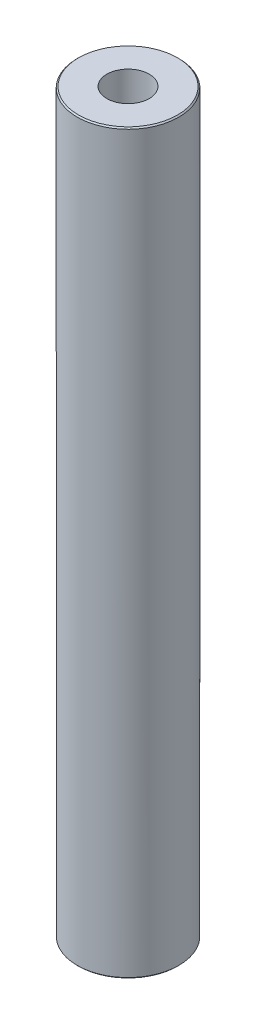
ISO-10303-21;
HEADER;
FILE_DESCRIPTION(('STEP AP214'),'2;1');
FILE_NAME('part.step','',(''),(''),'','','');
FILE_SCHEMA(('AUTOMOTIVE_DESIGN { 1 0 10303 214 1 1 1 1 }'));
ENDSEC;
DATA;
#1=APPLICATION_CONTEXT('core data for automotive mechanical design processes');
#2=APPLICATION_PROTOCOL_DEFINITION('international standard','automotive_design',2000,#1);
#3=PRODUCT_CONTEXT('',#1,'mechanical');
#4=PRODUCT('Part','Part','',(#3));
#5=PRODUCT_RELATED_PRODUCT_CATEGORY('part','',(#4));
#6=PRODUCT_DEFINITION_FORMATION('','',#4);
#7=PRODUCT_DEFINITION_CONTEXT('part definition',#1,'design');
#8=PRODUCT_DEFINITION('design','',#6,#7);
#9=PRODUCT_DEFINITION_SHAPE('','',#8);
#10=(LENGTH_UNIT() NAMED_UNIT(*) SI_UNIT(.MILLI.,.METRE.));
#11=(NAMED_UNIT(*) PLANE_ANGLE_UNIT() SI_UNIT($,.RADIAN.));
#12=(NAMED_UNIT(*) SI_UNIT($,.STERADIAN.) SOLID_ANGLE_UNIT());
#13=UNCERTAINTY_MEASURE_WITH_UNIT(LENGTH_MEASURE(1.E-05),#10,'distance_accuracy_value','');
#14=(GEOMETRIC_REPRESENTATION_CONTEXT(3) GLOBAL_UNCERTAINTY_ASSIGNED_CONTEXT((#13)) GLOBAL_UNIT_ASSIGNED_CONTEXT((#10,
#11,#12)) REPRESENTATION_CONTEXT('',''));
#15=CARTESIAN_POINT('',(0.,0.,0.));
#16=DIRECTION('',(0.,0.,1.));
#17=DIRECTION('',(1.,0.,0.));
#18=AXIS2_PLACEMENT_3D('',#15,#16,#17);
#19=CARTESIAN_POINT('',(0.,471.694288005632,0.));
#20=DIRECTION('',(0.,-1.,0.));
#21=DIRECTION('',(0.,0.,-1.));
#22=AXIS2_PLACEMENT_3D('',#19,#20,#21);
#23=CYLINDRICAL_SURFACE('',#22,32.5);
#24=CARTESIAN_POINT('',(0.,470.893037574134,0.));
#25=DIRECTION('',(0.,1.,0.));
#26=DIRECTION('',(0.,0.,1.));
#27=AXIS2_PLACEMENT_3D('',#24,#25,#26);
#28=CIRCLE('',#27,32.5);
#29=CARTESIAN_POINT('',(0.,470.893037574134,-32.5));
#30=VERTEX_POINT('',#29);
#31=EDGE_CURVE('E50',#30,#30,#28,.F.);
#32=CARTESIAN_POINT('',(0.,0.801250431498535,0.));
#33=DIRECTION('',(0.,1.,0.));
#34=DIRECTION('',(0.,0.,1.));
#35=AXIS2_PLACEMENT_3D('',#32,#33,#34);
#36=CIRCLE('',#35,32.5);
#37=CARTESIAN_POINT('',(0.,0.801250431498535,-32.5));
#38=VERTEX_POINT('',#37);
#39=EDGE_CURVE('E51',#38,#38,#36,.T.);
#40=CARTESIAN_POINT('',(0.,470.893037574134,-32.5));
#41=CARTESIAN_POINT('',(0.,465.996248124732,-32.5));
#42=CARTESIAN_POINT('',(0.,461.099458675329,-32.5));
#43=CARTESIAN_POINT('',(0.,451.305879776525,-32.5));
#44=CARTESIAN_POINT('',(0.,446.409090327122,-32.5));
#45=CARTESIAN_POINT('',(0.,436.615511428317,-32.5));
#46=CARTESIAN_POINT('',(0.,431.718721978915,-32.5));
#47=CARTESIAN_POINT('',(0.,421.92514308011,-32.5));
#48=CARTESIAN_POINT('',(0.,417.028353630707,-32.5));
#49=CARTESIAN_POINT('',(0.,407.234774731902,-32.5));
#50=CARTESIAN_POINT('',(0.,402.3379852825,-32.5));
#51=CARTESIAN_POINT('',(0.,392.544406383695,-32.5));
#52=CARTESIAN_POINT('',(0.,387.647616934293,-32.5));
#53=CARTESIAN_POINT('',(0.,377.854038035488,-32.5));
#54=CARTESIAN_POINT('',(0.,372.957248586085,-32.5));
#55=CARTESIAN_POINT('',(0.,363.16366968728,-32.5));
#56=CARTESIAN_POINT('',(0.,358.266880237878,-32.5));
#57=CARTESIAN_POINT('',(0.,348.473301339073,-32.5));
#58=CARTESIAN_POINT('',(0.,343.576511889671,-32.5));
#59=CARTESIAN_POINT('',(0.,333.782932990866,-32.5));
#60=CARTESIAN_POINT('',(0.,328.886143541463,-32.5));
#61=CARTESIAN_POINT('',(0.,319.092564642658,-32.5));
#62=CARTESIAN_POINT('',(0.,314.195775193256,-32.5));
#63=CARTESIAN_POINT('',(0.,304.402196294451,-32.5));
#64=CARTESIAN_POINT('',(0.,299.505406845048,-32.5));
#65=CARTESIAN_POINT('',(0.,289.711827946243,-32.5));
#66=CARTESIAN_POINT('',(0.,284.815038496841,-32.5));
#67=CARTESIAN_POINT('',(0.,275.021459598036,-32.5));
#68=CARTESIAN_POINT('',(0.,270.124670148634,-32.5));
#69=CARTESIAN_POINT('',(0.,260.331091249829,-32.5));
#70=CARTESIAN_POINT('',(0.,255.434301800426,-32.5));
#71=CARTESIAN_POINT('',(0.,245.640722901621,-32.5));
#72=CARTESIAN_POINT('',(0.,240.743933452219,-32.5));
#73=CARTESIAN_POINT('',(0.,230.950354553414,-32.5));
#74=CARTESIAN_POINT('',(0.,226.053565104012,-32.5));
#75=CARTESIAN_POINT('',(0.,216.259986205207,-32.5));
#76=CARTESIAN_POINT('',(0.,211.363196755804,-32.5));
#77=CARTESIAN_POINT('',(0.,201.569617856999,-32.5));
#78=CARTESIAN_POINT('',(0.,196.672828407597,-32.5));
#79=CARTESIAN_POINT('',(0.,186.879249508792,-32.5));
#80=CARTESIAN_POINT('',(0.,181.982460059389,-32.5));
#81=CARTESIAN_POINT('',(0.,172.188881160585,-32.5));
#82=CARTESIAN_POINT('',(0.,167.292091711182,-32.5));
#83=CARTESIAN_POINT('',(0.,157.498512812377,-32.5));
#84=CARTESIAN_POINT('',(0.,152.601723362975,-32.5));
#85=CARTESIAN_POINT('',(0.,142.80814446417,-32.5));
#86=CARTESIAN_POINT('',(0.,137.911355014767,-32.5));
#87=CARTESIAN_POINT('',(0.,128.117776115962,-32.5));
#88=CARTESIAN_POINT('',(0.,123.22098666656,-32.5));
#89=CARTESIAN_POINT('',(0.,113.427407767755,-32.5));
#90=CARTESIAN_POINT('',(0.,108.530618318353,-32.5));
#91=CARTESIAN_POINT('',(0.,98.7370394195477,-32.5));
#92=CARTESIAN_POINT('',(0.,93.8402499701453,-32.5));
#93=CARTESIAN_POINT('',(0.,84.0466710713404,-32.5));
#94=CARTESIAN_POINT('',(0.,79.1498816219379,-32.5));
#95=CARTESIAN_POINT('',(0.,69.356302723133,-32.5));
#96=CARTESIAN_POINT('',(0.,64.4595132737306,-32.5));
#97=CARTESIAN_POINT('',(0.,54.6659343749256,-32.5));
#98=CARTESIAN_POINT('',(0.,49.7691449255232,-32.5));
#99=CARTESIAN_POINT('',(0.,39.9755660267182,-32.5));
#100=CARTESIAN_POINT('',(0.,35.0787765773157,-32.5));
#101=CARTESIAN_POINT('',(0.,25.2851976785108,-32.5));
#102=CARTESIAN_POINT('',(0.,20.3884082291084,-32.5));
#103=CARTESIAN_POINT('',(0.,10.5948293303034,-32.5));
#104=CARTESIAN_POINT('',(0.,5.69803988090099,-32.5));
#105=CARTESIAN_POINT('',(0.,0.801250431498535,-32.5));
#106=B_SPLINE_CURVE_WITH_KNOTS('',3,(#40,#41,#42,#43,#44,#45,#46,#47,#48,#49,#50,#51,#52,#53,
#54,#55,#56,#57,#58,#59,#60,#61,#62,#63,#64,#65,#66,#67,#68,#69,#70,#71,#72,#73,#74,#75,#76,#77,
#78,#79,#80,#81,#82,#83,#84,#85,#86,#87,#88,#89,#90,#91,#92,#93,#94,#95,#96,#97,#98,#99,#100,
#101,#102,#103,#104,#105),.UNSPECIFIED.,.F.,.F.,(4,2,2,2,2,2,2,2,2,2,2,2,2,2,2,2,2,2,2,2,2,2,2,
2,2,2,2,2,2,2,2,2,4),(0.,14.6903683482074,29.3807366964148,44.0711050446221,58.7614733928295,
73.4518417410369,88.1422100892442,102.832578437452,117.522946785659,132.213315133866,
146.903683482074,161.594051830281,176.284420178488,190.974788526696,205.665156874903,
220.355525223111,235.045893571318,249.736261919525,264.426630267733,279.11699861594,
293.807366964147,308.497735312355,323.188103660562,337.87847200877,352.568840356977,
367.259208705184,381.949577053392,396.639945401599,411.330313749806,426.020682098014,
440.711050446221,455.401418794429,470.091787142636),.UNSPECIFIED.);
#107=EDGE_CURVE('BSEAM39',#30,#38,#106,.T.);
#108=ORIENTED_EDGE('',*,*,#31,.T.);
#109=ORIENTED_EDGE('',*,*,#39,.T.);
#110=ORIENTED_EDGE('',*,*,#107,.T.);
#111=ORIENTED_EDGE('',*,*,#107,.F.);
#112=EDGE_LOOP('',(#108,#110,#109,#111));
#113=FACE_BOUND('',#112,.T.);
#114=ADVANCED_FACE('F39',(#113),#23,.T.);
#115=CARTESIAN_POINT('',(0.,471.694288005632,0.));
#116=DIRECTION('',(0.,1.,0.));
#117=DIRECTION('',(0.,0.,1.));
#118=AXIS2_PLACEMENT_3D('',#115,#116,#117);
#119=PLANE('',#118);
#120=CARTESIAN_POINT('',(0.,471.694288005632,0.));
#121=DIRECTION('',(0.,1.,0.));
#122=DIRECTION('',(0.,0.,1.));
#123=AXIS2_PLACEMENT_3D('',#120,#121,#122);
#124=CIRCLE('',#123,31.6987495685021);
#125=CARTESIAN_POINT('',(0.,471.694288005632,31.6987495685021));
#126=VERTEX_POINT('',#125);
#127=EDGE_CURVE('E54',#126,#126,#124,.T.);
#128=ORIENTED_EDGE('',*,*,#127,.T.);
#129=EDGE_LOOP('',(#128));
#130=FACE_BOUND('',#129,.T.);
#131=CARTESIAN_POINT('',(0.,471.694288005632,0.));
#132=DIRECTION('',(0.,1.,0.));
#133=DIRECTION('',(0.,0.,1.));
#134=AXIS2_PLACEMENT_3D('',#131,#132,#133);
#135=CIRCLE('',#134,13.5626044162573);
#136=CARTESIAN_POINT('',(0.,471.694288005632,-13.5626044162573));
#137=VERTEX_POINT('',#136);
#138=EDGE_CURVE('E58',#137,#137,#135,.T.);
#139=ORIENTED_EDGE('',*,*,#138,.F.);
#140=EDGE_LOOP('',(#139));
#141=FACE_BOUND('',#140,.T.);
#142=ADVANCED_FACE('F69',(#130,#141),#119,.T.);
#143=CARTESIAN_POINT('',(0.,0.,0.));
#144=DIRECTION('',(0.,1.,0.));
#145=DIRECTION('',(0.,0.,1.));
#146=AXIS2_PLACEMENT_3D('',#143,#144,#145);
#147=PLANE('',#146);
#148=CARTESIAN_POINT('',(0.,0.,0.));
#149=DIRECTION('',(0.,1.,0.));
#150=DIRECTION('',(0.,0.,1.));
#151=AXIS2_PLACEMENT_3D('',#148,#149,#150);
#152=CIRCLE('',#151,31.6987495685014);
#153=CARTESIAN_POINT('',(0.,0.,31.6987495685014));
#154=VERTEX_POINT('',#153);
#155=EDGE_CURVE('E10',#154,#154,#152,.F.);
#156=ORIENTED_EDGE('',*,*,#155,.T.);
#157=EDGE_LOOP('',(#156));
#158=FACE_BOUND('',#157,.T.);
#159=CARTESIAN_POINT('',(0.,0.,0.));
#160=DIRECTION('',(0.,1.,0.));
#161=DIRECTION('',(0.,0.,1.));
#162=AXIS2_PLACEMENT_3D('',#159,#160,#161);
#163=CIRCLE('',#162,13.5626044162573);
#164=CARTESIAN_POINT('',(0.,0.,-13.5626044162573));
#165=VERTEX_POINT('',#164);
#166=EDGE_CURVE('E63',#165,#165,#163,.T.);
#167=ORIENTED_EDGE('',*,*,#166,.T.);
#168=EDGE_LOOP('',(#167));
#169=FACE_BOUND('',#168,.T.);
#170=ADVANCED_FACE('F75',(#158,#169),#147,.F.);
#171=CARTESIAN_POINT('',(0.,471.694288005632,0.));
#172=DIRECTION('',(0.,-1.,0.));
#173=DIRECTION('',(0.,0.,-1.));
#174=AXIS2_PLACEMENT_3D('',#171,#172,#173);
#175=CYLINDRICAL_SURFACE('',#174,13.5626044162573);
#176=CARTESIAN_POINT('',(0.,471.694288005632,-13.5626044162573));
#177=CARTESIAN_POINT('',(0.,466.780805838907,-13.5626044162573));
#178=CARTESIAN_POINT('',(0.,461.867323672182,-13.5626044162573));
#179=CARTESIAN_POINT('',(0.,452.040359338731,-13.5626044162573));
#180=CARTESIAN_POINT('',(0.,447.126877172006,-13.5626044162573));
#181=CARTESIAN_POINT('',(0.,437.299912838555,-13.5626044162573));
#182=CARTESIAN_POINT('',(0.,432.38643067183,-13.5626044162573));
#183=CARTESIAN_POINT('',(0.,422.559466338379,-13.5626044162573));
#184=CARTESIAN_POINT('',(0.,417.645984171654,-13.5626044162573));
#185=CARTESIAN_POINT('',(0.,407.819019838203,-13.5626044162573));
#186=CARTESIAN_POINT('',(0.,402.905537671478,-13.5626044162573));
#187=CARTESIAN_POINT('',(0.,393.078573338027,-13.5626044162573));
#188=CARTESIAN_POINT('',(0.,388.165091171302,-13.5626044162573));
#189=CARTESIAN_POINT('',(0.,378.338126837851,-13.5626044162573));
#190=CARTESIAN_POINT('',(0.,373.424644671126,-13.5626044162573));
#191=CARTESIAN_POINT('',(0.,363.597680337675,-13.5626044162573));
#192=CARTESIAN_POINT('',(0.,358.68419817095,-13.5626044162573));
#193=CARTESIAN_POINT('',(0.,348.857233837499,-13.5626044162573));
#194=CARTESIAN_POINT('',(0.,343.943751670774,-13.5626044162573));
#195=CARTESIAN_POINT('',(0.,334.116787337323,-13.5626044162573));
#196=CARTESIAN_POINT('',(0.,329.203305170598,-13.5626044162573));
#197=CARTESIAN_POINT('',(0.,319.376340837147,-13.5626044162573));
#198=CARTESIAN_POINT('',(0.,314.462858670421,-13.5626044162573));
#199=CARTESIAN_POINT('',(0.,304.635894336971,-13.5626044162573));
#200=CARTESIAN_POINT('',(0.,299.722412170245,-13.5626044162573));
#201=CARTESIAN_POINT('',(0.,289.895447836795,-13.5626044162573));
#202=CARTESIAN_POINT('',(0.,284.981965670069,-13.5626044162573));
#203=CARTESIAN_POINT('',(0.,275.155001336619,-13.5626044162573));
#204=CARTESIAN_POINT('',(0.,270.241519169893,-13.5626044162573));
#205=CARTESIAN_POINT('',(0.,260.414554836443,-13.5626044162573));
#206=CARTESIAN_POINT('',(0.,255.501072669717,-13.5626044162573));
#207=CARTESIAN_POINT('',(0.,245.674108336267,-13.5626044162573));
#208=CARTESIAN_POINT('',(0.,240.760626169541,-13.5626044162573));
#209=CARTESIAN_POINT('',(0.,230.933661836091,-13.5626044162573));
#210=CARTESIAN_POINT('',(0.,226.020179669365,-13.5626044162573));
#211=CARTESIAN_POINT('',(0.,216.193215335915,-13.5626044162573));
#212=CARTESIAN_POINT('',(0.,211.279733169189,-13.5626044162573));
#213=CARTESIAN_POINT('',(0.,201.452768835739,-13.5626044162573));
#214=CARTESIAN_POINT('',(0.,196.539286669013,-13.5626044162573));
#215=CARTESIAN_POINT('',(0.,186.712322335563,-13.5626044162573));
#216=CARTESIAN_POINT('',(0.,181.798840168837,-13.5626044162573));
#217=CARTESIAN_POINT('',(0.,171.971875835387,-13.5626044162573));
#218=CARTESIAN_POINT('',(0.,167.058393668661,-13.5626044162573));
#219=CARTESIAN_POINT('',(0.,157.231429335211,-13.5626044162573));
#220=CARTESIAN_POINT('',(0.,152.317947168485,-13.5626044162573));
#221=CARTESIAN_POINT('',(0.,142.490982835035,-13.5626044162573));
#222=CARTESIAN_POINT('',(0.,137.577500668309,-13.5626044162573));
#223=CARTESIAN_POINT('',(0.,127.750536334859,-13.5626044162573));
#224=CARTESIAN_POINT('',(0.,122.837054168133,-13.5626044162573));
#225=CARTESIAN_POINT('',(0.,113.010089834683,-13.5626044162573));
#226=CARTESIAN_POINT('',(0.,108.096607667957,-13.5626044162573));
#227=CARTESIAN_POINT('',(0.,98.2696433345067,-13.5626044162573));
#228=CARTESIAN_POINT('',(0.,93.3561611677814,-13.5626044162573));
#229=CARTESIAN_POINT('',(0.,83.5291968343307,-13.5626044162573));
#230=CARTESIAN_POINT('',(0.,78.6157146676053,-13.5626044162573));
#231=CARTESIAN_POINT('',(0.,68.7887503341547,-13.5626044162573));
#232=CARTESIAN_POINT('',(0.,63.8752681674293,-13.5626044162573));
#233=CARTESIAN_POINT('',(0.,54.0483038339787,-13.5626044162573));
#234=CARTESIAN_POINT('',(0.,49.1348216672533,-13.5626044162573));
#235=CARTESIAN_POINT('',(0.,39.3078573338026,-13.5626044162573));
#236=CARTESIAN_POINT('',(0.,34.3943751670773,-13.5626044162573));
#237=CARTESIAN_POINT('',(0.,24.5674108336266,-13.5626044162573));
#238=CARTESIAN_POINT('',(0.,19.6539286669013,-13.5626044162573));
#239=CARTESIAN_POINT('',(0.,9.82696433345063,-13.5626044162573));
#240=CARTESIAN_POINT('',(0.,4.91348216672529,-13.5626044162573));
#241=CARTESIAN_POINT('',(0.,0.,-13.5626044162573));
#242=B_SPLINE_CURVE_WITH_KNOTS('',3,(#176,#177,#178,#179,#180,#181,#182,#183,#184,#185,#186,
#187,#188,#189,#190,#191,#192,#193,#194,#195,#196,#197,#198,#199,#200,#201,#202,#203,#204,#205,
#206,#207,#208,#209,#210,#211,#212,#213,#214,#215,#216,#217,#218,#219,#220,#221,#222,#223,#224,
#225,#226,#227,#228,#229,#230,#231,#232,#233,#234,#235,#236,#237,#238,#239,#240,#241),
.UNSPECIFIED.,.F.,.F.,(4,2,2,2,2,2,2,2,2,2,2,2,2,2,2,2,2,2,2,2,2,2,2,2,2,2,2,2,2,2,2,2,4),(0.,
14.740446500176,29.4808930003521,44.221339500528,58.9617860007041,73.7022325008801,
88.4426790010561,103.183125501232,117.923572001408,132.664018501584,147.40446500176,
162.144911501936,176.885358002112,191.625804502288,206.366251002464,221.10669750264,
235.847144002816,250.587590502992,265.328037003168,280.068483503344,294.80893000352,
309.549376503696,324.289823003872,339.030269504048,353.770716004224,368.5111625044,
383.251609004576,397.992055504752,412.732502004928,427.472948505104,442.21339500528,
456.953841505456,471.694288005632),.UNSPECIFIED.);
#243=EDGE_CURVE('BSEAM70',#137,#165,#242,.T.);
#244=ORIENTED_EDGE('',*,*,#138,.T.);
#245=ORIENTED_EDGE('',*,*,#166,.F.);
#246=ORIENTED_EDGE('',*,*,#243,.T.);
#247=ORIENTED_EDGE('',*,*,#243,.F.);
#248=EDGE_LOOP('',(#244,#246,#245,#247));
#249=FACE_BOUND('',#248,.T.);
#250=ADVANCED_FACE('F70',(#249),#175,.F.);
#251=CARTESIAN_POINT('',(0.,471.694288005632,0.));
#252=DIRECTION('',(0.,-1.,0.));
#253=DIRECTION('',(0.,0.,-1.));
#254=AXIS2_PLACEMENT_3D('',#251,#252,#253);
#255=CONICAL_SURFACE('',#254,31.6987495685021,0.78539816339747);
#256=ORIENTED_EDGE('',*,*,#31,.F.);
#257=EDGE_LOOP('',(#256));
#258=FACE_BOUND('',#257,.T.);
#259=ORIENTED_EDGE('',*,*,#127,.F.);
#260=EDGE_LOOP('',(#259));
#261=FACE_BOUND('',#260,.T.);
#262=ADVANCED_FACE('F81',(#258,#261),#255,.T.);
#263=CARTESIAN_POINT('',(0.,0.801250431498535,0.));
#264=DIRECTION('',(0.,1.,0.));
#265=DIRECTION('',(0.,0.,1.));
#266=AXIS2_PLACEMENT_3D('',#263,#264,#265);
#267=CONICAL_SURFACE('',#266,32.5,0.785398163397466);
#268=ORIENTED_EDGE('',*,*,#155,.F.);
#269=EDGE_LOOP('',(#268));
#270=FACE_BOUND('',#269,.T.);
#271=ORIENTED_EDGE('',*,*,#39,.F.);
#272=EDGE_LOOP('',(#271));
#273=FACE_BOUND('',#272,.T.);
#274=ADVANCED_FACE('F45',(#270,#273),#267,.T.);
#275=CLOSED_SHELL('',(#114,#142,#170,#250,#262,#274));
#276=MANIFOLD_SOLID_BREP('B2',#275);
#277=ADVANCED_BREP_SHAPE_REPRESENTATION('',(#18,#276),#14);
#278=SHAPE_DEFINITION_REPRESENTATION(#9,#277);
ENDSEC;
END-ISO-10303-21;
